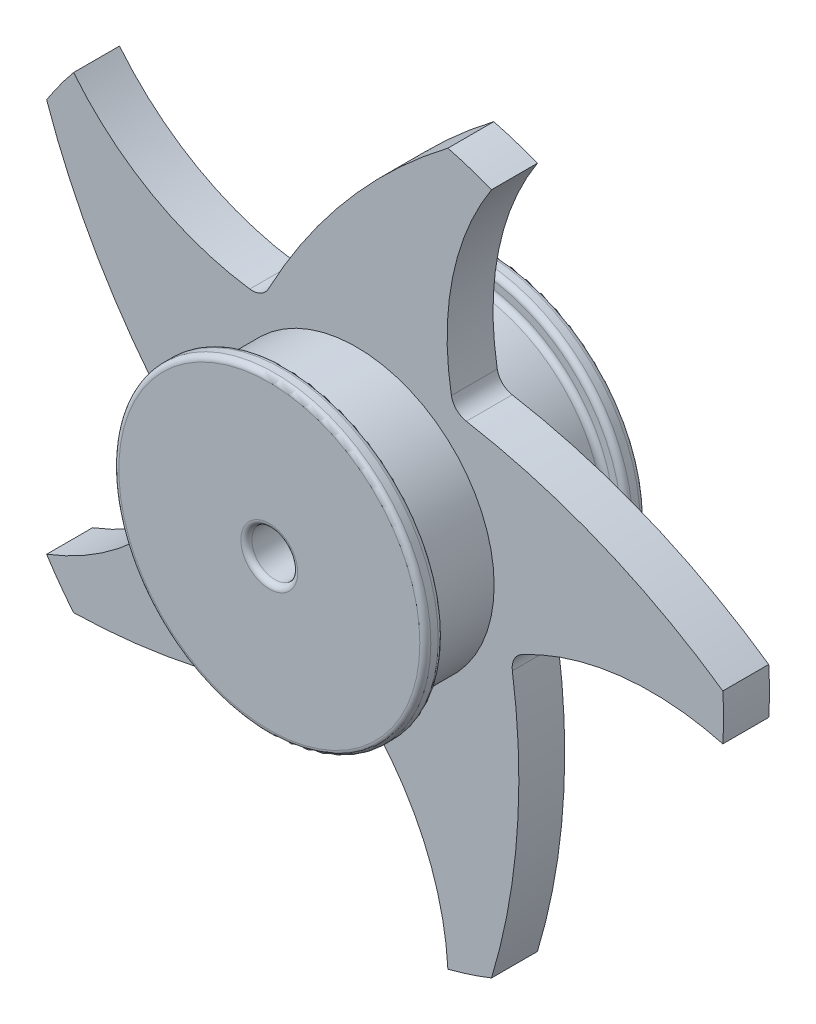
ISO-10303-21;
HEADER;
FILE_DESCRIPTION(('STEP AP214'),'2;1');
FILE_NAME('part.step','',(''),(''),'','','');
FILE_SCHEMA(('AUTOMOTIVE_DESIGN { 1 0 10303 214 1 1 1 1 }'));
ENDSEC;
DATA;
#1=APPLICATION_CONTEXT('core data for automotive mechanical design processes');
#2=APPLICATION_PROTOCOL_DEFINITION('international standard','automotive_design',2000,#1);
#3=PRODUCT_CONTEXT('',#1,'mechanical');
#4=PRODUCT('Part','Part','',(#3));
#5=PRODUCT_RELATED_PRODUCT_CATEGORY('part','',(#4));
#6=PRODUCT_DEFINITION_FORMATION('','',#4);
#7=PRODUCT_DEFINITION_CONTEXT('part definition',#1,'design');
#8=PRODUCT_DEFINITION('design','',#6,#7);
#9=PRODUCT_DEFINITION_SHAPE('','',#8);
#10=(LENGTH_UNIT() NAMED_UNIT(*) SI_UNIT(.MILLI.,.METRE.));
#11=(NAMED_UNIT(*) PLANE_ANGLE_UNIT() SI_UNIT($,.RADIAN.));
#12=(NAMED_UNIT(*) SI_UNIT($,.STERADIAN.) SOLID_ANGLE_UNIT());
#13=UNCERTAINTY_MEASURE_WITH_UNIT(LENGTH_MEASURE(1.E-05),#10,'distance_accuracy_value','');
#14=(GEOMETRIC_REPRESENTATION_CONTEXT(3) GLOBAL_UNCERTAINTY_ASSIGNED_CONTEXT((#13)) GLOBAL_UNIT_ASSIGNED_CONTEXT((#10,
#11,#12)) REPRESENTATION_CONTEXT('',''));
#15=CARTESIAN_POINT('',(0.,0.,0.));
#16=DIRECTION('',(0.,0.,1.));
#17=DIRECTION('',(1.,0.,0.));
#18=AXIS2_PLACEMENT_3D('',#15,#16,#17);
#19=CARTESIAN_POINT('',(0.,0.,60.));
#20=DIRECTION('',(0.,0.,-1.));
#21=DIRECTION('',(-1.,0.,0.));
#22=AXIS2_PLACEMENT_3D('',#19,#20,#21);
#23=CYLINDRICAL_SURFACE('',#22,75.);
#24=CARTESIAN_POINT('',(0.,0.,-47.));
#25=DIRECTION('',(0.,0.,-1.));
#26=DIRECTION('',(-1.,0.,0.));
#27=AXIS2_PLACEMENT_3D('',#24,#25,#26);
#28=CIRCLE('',#27,75.);
#29=CARTESIAN_POINT('',(-75.,0.,-47.));
#30=VERTEX_POINT('',#29);
#31=EDGE_CURVE('E387',#30,#30,#28,.F.);
#32=ORIENTED_EDGE('',*,*,#31,.T.);
#33=EDGE_LOOP('',(#32));
#34=FACE_BOUND('',#33,.T.);
#35=CARTESIAN_POINT('',(0.,0.,-12.5));
#36=DIRECTION('',(0.,0.,-1.));
#37=DIRECTION('',(1.,0.,0.));
#38=AXIS2_PLACEMENT_3D('',#35,#36,#37);
#39=CIRCLE('',#38,75.);
#40=CARTESIAN_POINT('',(75.,0.,-12.5));
#41=VERTEX_POINT('',#40);
#42=EDGE_CURVE('E305',#41,#41,#39,.T.);
#43=ORIENTED_EDGE('',*,*,#42,.T.);
#44=EDGE_LOOP('',(#43));
#45=FACE_BOUND('',#44,.T.);
#46=ADVANCED_FACE('F41',(#34,#45),#23,.T.);
#47=CARTESIAN_POINT('',(160.789981202373,-157.389904202718,12.5));
#48=DIRECTION('',(0.,0.,-1.));
#49=DIRECTION('',(-1.,0.,0.));
#50=AXIS2_PLACEMENT_3D('',#47,#48,#49);
#51=CYLINDRICAL_SURFACE('',#50,150.);
#52=CARTESIAN_POINT('',(160.789981202373,-157.389904202718,12.5));
#53=DIRECTION('',(0.,0.,-1.));
#54=DIRECTION('',(-1.,0.,0.));
#55=AXIS2_PLACEMENT_3D('',#52,#53,#54);
#56=CIRCLE('',#55,150.);
#57=CARTESIAN_POINT('',(90.1061457749531,-25.0879941285639,12.5));
#58=VERTEX_POINT('',#57);
#59=CARTESIAN_POINT('',(199.608992783391,-12.5,12.5));
#60=VERTEX_POINT('',#59);
#61=EDGE_CURVE('E310',#58,#60,#56,.T.);
#62=ORIENTED_EDGE('',*,*,#61,.F.);
#63=DIRECTION('',(0.,0.,-1.));
#64=VECTOR('',#63,1.);
#65=CARTESIAN_POINT('',(90.1061457749531,-25.0879941285639,12.5));
#66=LINE('',#65,#64);
#67=CARTESIAN_POINT('',(90.1061457749531,-25.0879941285639,-12.5));
#68=VERTEX_POINT('',#67);
#69=EDGE_CURVE('E428',#58,#68,#66,.T.);
#70=ORIENTED_EDGE('',*,*,#69,.T.);
#71=CARTESIAN_POINT('',(160.789981202373,-157.389904202718,-12.5));
#72=DIRECTION('',(0.,0.,-1.));
#73=DIRECTION('',(-1.,0.,0.));
#74=AXIS2_PLACEMENT_3D('',#71,#72,#73);
#75=CIRCLE('',#74,150.);
#76=CARTESIAN_POINT('',(199.608992783391,-12.5,-12.5));
#77=VERTEX_POINT('',#76);
#78=EDGE_CURVE('E324',#68,#77,#75,.T.);
#79=ORIENTED_EDGE('',*,*,#78,.T.);
#80=DIRECTION('',(0.,0.,-1.));
#81=VECTOR('',#80,1.);
#82=CARTESIAN_POINT('',(199.608992783391,-12.5,12.5));
#83=LINE('',#82,#81);
#84=EDGE_CURVE('E335',#60,#77,#83,.T.);
#85=ORIENTED_EDGE('',*,*,#84,.F.);
#86=EDGE_LOOP('',(#62,#70,#79,#85));
#87=FACE_BOUND('',#86,.T.);
#88=ADVANCED_FACE('F478',(#87),#51,.F.);
#89=CARTESIAN_POINT('',(0.,-275.,12.5));
#90=DIRECTION('',(0.,0.,-1.));
#91=DIRECTION('',(-1.,0.,0.));
#92=AXIS2_PLACEMENT_3D('',#89,#90,#91);
#93=CYLINDRICAL_SURFACE('',#92,350.);
#94=CARTESIAN_POINT('',(0.,-275.,-12.5));
#95=DIRECTION('',(0.,0.,1.));
#96=DIRECTION('',(-1.,0.,0.));
#97=AXIS2_PLACEMENT_3D('',#94,#95,#96);
#98=CIRCLE('',#97,350.);
#99=CARTESIAN_POINT('',(199.608992783391,12.5,-12.5));
#100=VERTEX_POINT('',#99);
#101=CARTESIAN_POINT('',(59.8393418292631,69.8467096688624,-12.5));
#102=VERTEX_POINT('',#101);
#103=EDGE_CURVE('E311',#100,#102,#98,.T.);
#104=ORIENTED_EDGE('',*,*,#103,.T.);
#105=DIRECTION('',(0.,0.,-1.));
#106=VECTOR('',#105,1.);
#107=CARTESIAN_POINT('',(59.8393418292631,69.8467096688624,12.5));
#108=LINE('',#107,#106);
#109=CARTESIAN_POINT('',(59.8393418292631,69.8467096688624,12.5));
#110=VERTEX_POINT('',#109);
#111=EDGE_CURVE('E63',#102,#110,#108,.F.);
#112=ORIENTED_EDGE('',*,*,#111,.T.);
#113=CARTESIAN_POINT('',(0.,-275.,12.5));
#114=DIRECTION('',(0.,0.,1.));
#115=DIRECTION('',(-1.,0.,0.));
#116=AXIS2_PLACEMENT_3D('',#113,#114,#115);
#117=CIRCLE('',#116,350.);
#118=CARTESIAN_POINT('',(199.608992783391,12.5,12.5));
#119=VERTEX_POINT('',#118);
#120=EDGE_CURVE('E317',#119,#110,#117,.T.);
#121=ORIENTED_EDGE('',*,*,#120,.F.);
#122=DIRECTION('',(0.,0.,-1.));
#123=VECTOR('',#122,1.);
#124=CARTESIAN_POINT('',(199.608992783391,12.5,12.5));
#125=LINE('',#124,#123);
#126=EDGE_CURVE('E320',#119,#100,#125,.T.);
#127=ORIENTED_EDGE('',*,*,#126,.T.);
#128=EDGE_LOOP('',(#104,#112,#121,#127));
#129=FACE_BOUND('',#128,.T.);
#130=ADVANCED_FACE('F554',(#129),#93,.T.);
#131=CARTESIAN_POINT('',(0.,0.,12.5));
#132=DIRECTION('',(0.,0.,-1.));
#133=DIRECTION('',(1.,0.,0.));
#134=AXIS2_PLACEMENT_3D('',#131,#132,#133);
#135=CIRCLE('',#134,75.);
#136=CARTESIAN_POINT('',(75.,0.,12.5));
#137=VERTEX_POINT('',#136);
#138=EDGE_CURVE('E306',#137,#137,#135,.T.);
#139=ORIENTED_EDGE('',*,*,#138,.F.);
#140=EDGE_LOOP('',(#139));
#141=FACE_BOUND('',#140,.T.);
#142=CARTESIAN_POINT('',(0.,0.,47.));
#143=DIRECTION('',(0.,0.,1.));
#144=DIRECTION('',(1.,0.,0.));
#145=AXIS2_PLACEMENT_3D('',#142,#143,#144);
#146=CIRCLE('',#145,75.);
#147=CARTESIAN_POINT('',(75.,0.,47.));
#148=VERTEX_POINT('',#147);
#149=EDGE_CURVE('E367',#148,#148,#146,.F.);
#150=ORIENTED_EDGE('',*,*,#149,.T.);
#151=EDGE_LOOP('',(#150));
#152=FACE_BOUND('',#151,.T.);
#153=ADVANCED_FACE('F550',(#141,#152),#23,.T.);
#154=CARTESIAN_POINT('',(0.,0.,60.));
#155=DIRECTION('',(0.,0.,1.));
#156=DIRECTION('',(1.,0.,0.));
#157=AXIS2_PLACEMENT_3D('',#154,#155,#156);
#158=PLANE('',#157);
#159=CARTESIAN_POINT('',(0.,0.,60.));
#160=DIRECTION('',(0.,0.,1.));
#161=DIRECTION('',(1.,0.,0.));
#162=AXIS2_PLACEMENT_3D('',#159,#160,#161);
#163=CIRCLE('',#162,15.5);
#164=CARTESIAN_POINT('',(15.5,0.,60.));
#165=VERTEX_POINT('',#164);
#166=EDGE_CURVE('E355',#165,#165,#163,.F.);
#167=ORIENTED_EDGE('',*,*,#166,.T.);
#168=EDGE_LOOP('',(#167));
#169=FACE_BOUND('',#168,.T.);
#170=CARTESIAN_POINT('',(0.,0.,60.));
#171=DIRECTION('',(0.,0.,1.));
#172=DIRECTION('',(1.,0.,0.));
#173=AXIS2_PLACEMENT_3D('',#170,#171,#172);
#174=CIRCLE('',#173,82.);
#175=CARTESIAN_POINT('',(82.,0.,60.));
#176=VERTEX_POINT('',#175);
#177=EDGE_CURVE('E351',#176,#176,#174,.T.);
#178=ORIENTED_EDGE('',*,*,#177,.T.);
#179=EDGE_LOOP('',(#178));
#180=FACE_BOUND('',#179,.T.);
#181=ADVANCED_FACE('F560',(#169,#180),#158,.T.);
#182=CARTESIAN_POINT('',(0.,0.,-60.));
#183=DIRECTION('',(0.,0.,1.));
#184=DIRECTION('',(1.,0.,0.));
#185=AXIS2_PLACEMENT_3D('',#182,#183,#184);
#186=PLANE('',#185);
#187=CARTESIAN_POINT('',(0.,0.,-60.));
#188=DIRECTION('',(0.,0.,1.));
#189=DIRECTION('',(1.,0.,0.));
#190=AXIS2_PLACEMENT_3D('',#187,#188,#189);
#191=CIRCLE('',#190,82.);
#192=CARTESIAN_POINT('',(82.,0.,-60.));
#193=VERTEX_POINT('',#192);
#194=EDGE_CURVE('E399',#193,#193,#191,.F.);
#195=ORIENTED_EDGE('',*,*,#194,.T.);
#196=EDGE_LOOP('',(#195));
#197=FACE_BOUND('',#196,.T.);
#198=CARTESIAN_POINT('',(0.,0.,-60.));
#199=DIRECTION('',(0.,0.,1.));
#200=DIRECTION('',(1.,0.,0.));
#201=AXIS2_PLACEMENT_3D('',#198,#199,#200);
#202=CIRCLE('',#201,15.5);
#203=CARTESIAN_POINT('',(15.5,0.,-60.));
#204=VERTEX_POINT('',#203);
#205=EDGE_CURVE('E339',#204,#204,#202,.T.);
#206=ORIENTED_EDGE('',*,*,#205,.T.);
#207=EDGE_LOOP('',(#206));
#208=FACE_BOUND('',#207,.T.);
#209=ADVANCED_FACE('F566',(#197,#208),#186,.F.);
#210=CARTESIAN_POINT('',(0.,0.,60.));
#211=DIRECTION('',(0.,0.,-1.));
#212=DIRECTION('',(-1.,0.,0.));
#213=AXIS2_PLACEMENT_3D('',#210,#211,#212);
#214=CYLINDRICAL_SURFACE('',#213,12.5);
#215=CARTESIAN_POINT('',(0.,0.,-57.));
#216=DIRECTION('',(0.,0.,1.));
#217=DIRECTION('',(1.,0.,0.));
#218=AXIS2_PLACEMENT_3D('',#215,#216,#217);
#219=CIRCLE('',#218,12.5);
#220=CARTESIAN_POINT('',(12.5,0.,-57.));
#221=VERTEX_POINT('',#220);
#222=EDGE_CURVE('E347',#221,#221,#219,.F.);
#223=ORIENTED_EDGE('',*,*,#222,.T.);
#224=EDGE_LOOP('',(#223));
#225=FACE_BOUND('',#224,.T.);
#226=CARTESIAN_POINT('',(0.,0.,57.));
#227=DIRECTION('',(0.,0.,1.));
#228=DIRECTION('',(1.,0.,0.));
#229=AXIS2_PLACEMENT_3D('',#226,#227,#228);
#230=CIRCLE('',#229,12.5);
#231=CARTESIAN_POINT('',(12.5,0.,57.));
#232=VERTEX_POINT('',#231);
#233=EDGE_CURVE('E343',#232,#232,#230,.T.);
#234=ORIENTED_EDGE('',*,*,#233,.T.);
#235=EDGE_LOOP('',(#234));
#236=FACE_BOUND('',#235,.T.);
#237=ADVANCED_FACE('F598',(#225,#236),#214,.F.);
#238=CARTESIAN_POINT('',(0.,0.,50.));
#239=DIRECTION('',(0.,0.,1.));
#240=DIRECTION('',(1.,0.,0.));
#241=AXIS2_PLACEMENT_3D('',#238,#239,#240);
#242=CYLINDRICAL_SURFACE('',#241,85.);
#243=CARTESIAN_POINT('',(0.,0.,53.));
#244=DIRECTION('',(0.,0.,1.));
#245=DIRECTION('',(1.,0.,0.));
#246=AXIS2_PLACEMENT_3D('',#243,#244,#245);
#247=CIRCLE('',#246,85.);
#248=CARTESIAN_POINT('',(85.,0.,53.));
#249=VERTEX_POINT('',#248);
#250=EDGE_CURVE('E375',#249,#249,#247,.T.);
#251=ORIENTED_EDGE('',*,*,#250,.T.);
#252=EDGE_LOOP('',(#251));
#253=FACE_BOUND('',#252,.T.);
#254=CARTESIAN_POINT('',(0.,0.,57.));
#255=DIRECTION('',(0.,0.,1.));
#256=DIRECTION('',(1.,0.,0.));
#257=AXIS2_PLACEMENT_3D('',#254,#255,#256);
#258=CIRCLE('',#257,85.);
#259=CARTESIAN_POINT('',(85.,0.,57.));
#260=VERTEX_POINT('',#259);
#261=EDGE_CURVE('E371',#260,#260,#258,.F.);
#262=ORIENTED_EDGE('',*,*,#261,.T.);
#263=EDGE_LOOP('',(#262));
#264=FACE_BOUND('',#263,.T.);
#265=ADVANCED_FACE('F586',(#253,#264),#242,.T.);
#266=CARTESIAN_POINT('',(0.,0.,50.));
#267=DIRECTION('',(0.,0.,1.));
#268=DIRECTION('',(1.,0.,0.));
#269=AXIS2_PLACEMENT_3D('',#266,#267,#268);
#270=PLANE('',#269);
#271=CARTESIAN_POINT('',(0.,0.,50.));
#272=DIRECTION('',(0.,0.,1.));
#273=DIRECTION('',(1.,0.,0.));
#274=AXIS2_PLACEMENT_3D('',#271,#272,#273);
#275=CIRCLE('',#274,78.);
#276=CARTESIAN_POINT('',(78.,0.,50.));
#277=VERTEX_POINT('',#276);
#278=EDGE_CURVE('E363',#277,#277,#275,.T.);
#279=ORIENTED_EDGE('',*,*,#278,.T.);
#280=EDGE_LOOP('',(#279));
#281=FACE_BOUND('',#280,.T.);
#282=CARTESIAN_POINT('',(0.,0.,50.));
#283=DIRECTION('',(0.,0.,1.));
#284=DIRECTION('',(1.,0.,0.));
#285=AXIS2_PLACEMENT_3D('',#282,#283,#284);
#286=CIRCLE('',#285,82.);
#287=CARTESIAN_POINT('',(82.,0.,50.));
#288=VERTEX_POINT('',#287);
#289=EDGE_CURVE('E359',#288,#288,#286,.F.);
#290=ORIENTED_EDGE('',*,*,#289,.T.);
#291=EDGE_LOOP('',(#290));
#292=FACE_BOUND('',#291,.T.);
#293=ADVANCED_FACE('F582',(#281,#292),#270,.F.);
#294=CARTESIAN_POINT('',(0.,0.,-57.));
#295=DIRECTION('',(0.,0.,1.));
#296=DIRECTION('',(1.,0.,0.));
#297=AXIS2_PLACEMENT_3D('',#294,#295,#296);
#298=TOROIDAL_SURFACE('',#297,15.5,3.);
#299=ORIENTED_EDGE('',*,*,#222,.F.);
#300=EDGE_LOOP('',(#299));
#301=FACE_BOUND('',#300,.T.);
#302=ORIENTED_EDGE('',*,*,#205,.F.);
#303=EDGE_LOOP('',(#302));
#304=FACE_BOUND('',#303,.T.);
#305=ADVANCED_FACE('F585',(#301,#304),#298,.T.);
#306=CARTESIAN_POINT('',(0.,0.,57.));
#307=DIRECTION('',(0.,0.,1.));
#308=DIRECTION('',(1.,0.,0.));
#309=AXIS2_PLACEMENT_3D('',#306,#307,#308);
#310=TOROIDAL_SURFACE('',#309,15.5,3.);
#311=ORIENTED_EDGE('',*,*,#166,.F.);
#312=EDGE_LOOP('',(#311));
#313=FACE_BOUND('',#312,.T.);
#314=ORIENTED_EDGE('',*,*,#233,.F.);
#315=EDGE_LOOP('',(#314));
#316=FACE_BOUND('',#315,.T.);
#317=ADVANCED_FACE('F578',(#313,#316),#310,.T.);
#318=CARTESIAN_POINT('',(0.,0.,47.));
#319=DIRECTION('',(0.,0.,1.));
#320=DIRECTION('',(1.,0.,0.));
#321=AXIS2_PLACEMENT_3D('',#318,#319,#320);
#322=TOROIDAL_SURFACE('',#321,78.,3.);
#323=ORIENTED_EDGE('',*,*,#149,.F.);
#324=EDGE_LOOP('',(#323));
#325=FACE_BOUND('',#324,.T.);
#326=ORIENTED_EDGE('',*,*,#278,.F.);
#327=EDGE_LOOP('',(#326));
#328=FACE_BOUND('',#327,.T.);
#329=ADVANCED_FACE('F574',(#325,#328),#322,.F.);
#330=CARTESIAN_POINT('',(0.,0.,53.));
#331=DIRECTION('',(0.,0.,1.));
#332=DIRECTION('',(1.,0.,0.));
#333=AXIS2_PLACEMENT_3D('',#330,#331,#332);
#334=TOROIDAL_SURFACE('',#333,82.,3.);
#335=ORIENTED_EDGE('',*,*,#289,.F.);
#336=EDGE_LOOP('',(#335));
#337=FACE_BOUND('',#336,.T.);
#338=ORIENTED_EDGE('',*,*,#250,.F.);
#339=EDGE_LOOP('',(#338));
#340=FACE_BOUND('',#339,.T.);
#341=ADVANCED_FACE('F577',(#337,#340),#334,.T.);
#342=CARTESIAN_POINT('',(0.,0.,57.));
#343=DIRECTION('',(0.,0.,1.));
#344=DIRECTION('',(1.,0.,0.));
#345=AXIS2_PLACEMENT_3D('',#342,#343,#344);
#346=TOROIDAL_SURFACE('',#345,82.,3.);
#347=ORIENTED_EDGE('',*,*,#261,.F.);
#348=EDGE_LOOP('',(#347));
#349=FACE_BOUND('',#348,.T.);
#350=ORIENTED_EDGE('',*,*,#177,.F.);
#351=EDGE_LOOP('',(#350));
#352=FACE_BOUND('',#351,.T.);
#353=ADVANCED_FACE('F592',(#349,#352),#346,.T.);
#354=CARTESIAN_POINT('',(0.,0.,-50.));
#355=DIRECTION('',(0.,0.,-1.));
#356=DIRECTION('',(1.,0.,0.));
#357=AXIS2_PLACEMENT_3D('',#354,#355,#356);
#358=PLANE('',#357);
#359=CARTESIAN_POINT('',(0.,0.,-50.));
#360=DIRECTION('',(0.,0.,-1.));
#361=DIRECTION('',(-1.,0.,0.));
#362=AXIS2_PLACEMENT_3D('',#359,#360,#361);
#363=CIRCLE('',#362,78.);
#364=CARTESIAN_POINT('',(-78.,0.,-50.));
#365=VERTEX_POINT('',#364);
#366=EDGE_CURVE('E383',#365,#365,#363,.T.);
#367=ORIENTED_EDGE('',*,*,#366,.T.);
#368=EDGE_LOOP('',(#367));
#369=FACE_BOUND('',#368,.T.);
#370=CARTESIAN_POINT('',(0.,0.,-50.));
#371=DIRECTION('',(0.,0.,-1.));
#372=DIRECTION('',(-1.,0.,0.));
#373=AXIS2_PLACEMENT_3D('',#370,#371,#372);
#374=CIRCLE('',#373,82.);
#375=CARTESIAN_POINT('',(-82.,0.,-50.));
#376=VERTEX_POINT('',#375);
#377=EDGE_CURVE('E379',#376,#376,#374,.F.);
#378=ORIENTED_EDGE('',*,*,#377,.T.);
#379=EDGE_LOOP('',(#378));
#380=FACE_BOUND('',#379,.T.);
#381=ADVANCED_FACE('F604',(#369,#380),#358,.F.);
#382=CARTESIAN_POINT('',(0.,0.,-50.));
#383=DIRECTION('',(0.,0.,-1.));
#384=DIRECTION('',(-1.,0.,0.));
#385=AXIS2_PLACEMENT_3D('',#382,#383,#384);
#386=CYLINDRICAL_SURFACE('',#385,85.);
#387=CARTESIAN_POINT('',(0.,0.,-53.));
#388=DIRECTION('',(0.,0.,-1.));
#389=DIRECTION('',(-1.,0.,0.));
#390=AXIS2_PLACEMENT_3D('',#387,#388,#389);
#391=CIRCLE('',#390,85.);
#392=CARTESIAN_POINT('',(-85.,0.,-53.));
#393=VERTEX_POINT('',#392);
#394=EDGE_CURVE('E395',#393,#393,#391,.T.);
#395=ORIENTED_EDGE('',*,*,#394,.T.);
#396=EDGE_LOOP('',(#395));
#397=FACE_BOUND('',#396,.T.);
#398=CARTESIAN_POINT('',(0.,0.,-57.));
#399=DIRECTION('',(0.,0.,1.));
#400=DIRECTION('',(1.,0.,0.));
#401=AXIS2_PLACEMENT_3D('',#398,#399,#400);
#402=CIRCLE('',#401,85.);
#403=CARTESIAN_POINT('',(85.,0.,-57.));
#404=VERTEX_POINT('',#403);
#405=EDGE_CURVE('E391',#404,#404,#402,.T.);
#406=ORIENTED_EDGE('',*,*,#405,.T.);
#407=EDGE_LOOP('',(#406));
#408=FACE_BOUND('',#407,.T.);
#409=ADVANCED_FACE('F611',(#397,#408),#386,.T.);
#410=CARTESIAN_POINT('',(0.,0.,-47.));
#411=DIRECTION('',(0.,0.,-1.));
#412=DIRECTION('',(-1.,0.,0.));
#413=AXIS2_PLACEMENT_3D('',#410,#411,#412);
#414=TOROIDAL_SURFACE('',#413,78.,3.);
#415=ORIENTED_EDGE('',*,*,#31,.F.);
#416=EDGE_LOOP('',(#415));
#417=FACE_BOUND('',#416,.T.);
#418=ORIENTED_EDGE('',*,*,#366,.F.);
#419=EDGE_LOOP('',(#418));
#420=FACE_BOUND('',#419,.T.);
#421=ADVANCED_FACE('F615',(#417,#420),#414,.F.);
#422=CARTESIAN_POINT('',(0.,0.,-53.));
#423=DIRECTION('',(0.,0.,-1.));
#424=DIRECTION('',(-1.,0.,0.));
#425=AXIS2_PLACEMENT_3D('',#422,#423,#424);
#426=TOROIDAL_SURFACE('',#425,82.,3.);
#427=ORIENTED_EDGE('',*,*,#394,.F.);
#428=EDGE_LOOP('',(#427));
#429=FACE_BOUND('',#428,.T.);
#430=ORIENTED_EDGE('',*,*,#377,.F.);
#431=EDGE_LOOP('',(#430));
#432=FACE_BOUND('',#431,.T.);
#433=ADVANCED_FACE('F618',(#429,#432),#426,.T.);
#434=CARTESIAN_POINT('',(0.,0.,-57.));
#435=DIRECTION('',(0.,0.,1.));
#436=DIRECTION('',(1.,0.,0.));
#437=AXIS2_PLACEMENT_3D('',#434,#435,#436);
#438=TOROIDAL_SURFACE('',#437,82.,3.);
#439=ORIENTED_EDGE('',*,*,#194,.F.);
#440=EDGE_LOOP('',(#439));
#441=FACE_BOUND('',#440,.T.);
#442=ORIENTED_EDGE('',*,*,#405,.F.);
#443=EDGE_LOOP('',(#442));
#444=FACE_BOUND('',#443,.T.);
#445=ADVANCED_FACE('F622',(#441,#444),#438,.T.);
#446=CARTESIAN_POINT('',(0.,0.,12.5));
#447=DIRECTION('',(0.,0.,-1.));
#448=DIRECTION('',(-1.,0.,0.));
#449=AXIS2_PLACEMENT_3D('',#446,#447,#448);
#450=CYLINDRICAL_SURFACE('',#449,200.);
#451=CARTESIAN_POINT('',(0.,0.,-12.5));
#452=DIRECTION('',(0.,0.,1.));
#453=DIRECTION('',(1.,0.,0.));
#454=AXIS2_PLACEMENT_3D('',#451,#452,#453);
#455=CIRCLE('',#454,200.);
#456=EDGE_CURVE('E327',#77,#100,#455,.T.);
#457=ORIENTED_EDGE('',*,*,#456,.T.);
#458=ORIENTED_EDGE('',*,*,#126,.F.);
#459=CARTESIAN_POINT('',(0.,0.,12.5));
#460=DIRECTION('',(0.,0.,1.));
#461=DIRECTION('',(1.,0.,0.));
#462=AXIS2_PLACEMENT_3D('',#459,#460,#461);
#463=CIRCLE('',#462,200.);
#464=EDGE_CURVE('E314',#60,#119,#463,.T.);
#465=ORIENTED_EDGE('',*,*,#464,.F.);
#466=ORIENTED_EDGE('',*,*,#84,.T.);
#467=EDGE_LOOP('',(#457,#458,#465,#466));
#468=FACE_BOUND('',#467,.T.);
#469=ADVANCED_FACE('F482',(#468),#450,.T.);
#470=CARTESIAN_POINT('',(0.,-137.5,12.5));
#471=DIRECTION('',(0.,0.,1.));
#472=DIRECTION('',(1.,0.,0.));
#473=AXIS2_PLACEMENT_3D('',#470,#471,#472);
#474=PLANE('',#473);
#475=CARTESIAN_POINT('',(-261.540541981167,-84.9796734531098,12.5));
#476=DIRECTION('',(0.,0.,1.));
#477=DIRECTION('',(-0.309016994374945,0.951056516295155,0.));
#478=AXIS2_PLACEMENT_3D('',#475,#476,#477);
#479=CIRCLE('',#478,350.);
#480=CARTESIAN_POINT('',(73.5707774538231,-185.97672086807,12.5));
#481=VERTEX_POINT('',#480);
#482=CARTESIAN_POINT('',(84.919541929801,-35.3267756886817,12.5));
#483=VERTEX_POINT('',#482);
#484=EDGE_CURVE('E286',#481,#483,#479,.T.);
#485=ORIENTED_EDGE('',*,*,#484,.T.);
#486=CARTESIAN_POINT('',(94.8184014701144,-33.9081214668409,12.5));
#487=DIRECTION('',(0.,0.,1.));
#488=DIRECTION('',(1.,0.,0.));
#489=AXIS2_PLACEMENT_3D('',#486,#487,#488);
#490=CIRCLE('',#489,10.);
#491=EDGE_CURVE('E454',#483,#58,#490,.F.);
#492=ORIENTED_EDGE('',*,*,#491,.T.);
#493=ORIENTED_EDGE('',*,*,#61,.T.);
#494=ORIENTED_EDGE('',*,*,#464,.T.);
#495=ORIENTED_EDGE('',*,*,#120,.T.);
#496=CARTESIAN_POINT('',(61.5490373100992,79.6994728022585,12.5));
#497=DIRECTION('',(0.,0.,1.));
#498=DIRECTION('',(1.,0.,0.));
#499=AXIS2_PLACEMENT_3D('',#496,#497,#498);
#500=CIRCLE('',#499,10.);
#501=CARTESIAN_POINT('',(51.7044306388329,77.9434205570052,12.5));
#502=VERTEX_POINT('',#501);
#503=EDGE_CURVE('E11',#110,#502,#500,.F.);
#504=ORIENTED_EDGE('',*,*,#503,.T.);
#505=CARTESIAN_POINT('',(199.373530707827,104.284204235805,12.5));
#506=DIRECTION('',(0.,0.,-1.));
#507=DIRECTION('',(-0.309016994374958,-0.95105651629515,0.));
#508=AXIS2_PLACEMENT_3D('',#505,#506,#507);
#509=CIRCLE('',#508,150.);
#510=CARTESIAN_POINT('',(73.5707774538257,185.976720868069,12.5));
#511=VERTEX_POINT('',#510);
#512=EDGE_CURVE('E178',#502,#511,#509,.T.);
#513=ORIENTED_EDGE('',*,*,#512,.T.);
#514=CARTESIAN_POINT('',(0.,0.,12.5));
#515=DIRECTION('',(0.,0.,1.));
#516=DIRECTION('',(0.309016994374958,0.95105651629515,0.));
#517=AXIS2_PLACEMENT_3D('',#514,#515,#516);
#518=CIRCLE('',#517,200.);
#519=CARTESIAN_POINT('',(49.794364546447,193.702145727443,12.5));
#520=VERTEX_POINT('',#519);
#521=EDGE_CURVE('E185',#511,#520,#518,.T.);
#522=ORIENTED_EDGE('',*,*,#521,.T.);
#523=CARTESIAN_POINT('',(261.540541981166,-84.9796734531135,12.5));
#524=DIRECTION('',(0.,0.,1.));
#525=DIRECTION('',(-0.309016994374958,-0.95105651629515,0.));
#526=AXIS2_PLACEMENT_3D('',#523,#524,#525);
#527=CIRCLE('',#526,350.);
#528=CARTESIAN_POINT('',(-47.9367948148929,78.494416266385,12.5));
#529=VERTEX_POINT('',#528);
#530=EDGE_CURVE('E208',#520,#529,#527,.T.);
#531=ORIENTED_EDGE('',*,*,#530,.T.);
#532=CARTESIAN_POINT('',(-56.7790044376374,83.165104544085,12.5));
#533=DIRECTION('',(0.,0.,1.));
#534=DIRECTION('',(1.,0.,0.));
#535=AXIS2_PLACEMENT_3D('',#532,#533,#534);
#536=CIRCLE('',#535,10.);
#537=CARTESIAN_POINT('',(-58.1510502711927,73.2596772322208,12.5));
#538=VERTEX_POINT('',#537);
#539=EDGE_CURVE('E442',#529,#538,#536,.F.);
#540=ORIENTED_EDGE('',*,*,#539,.T.);
#541=CARTESIAN_POINT('',(-37.5703627678633,221.841086910182,12.5));
#542=DIRECTION('',(0.,0.,-1.));
#543=DIRECTION('',(0.809016994374942,-0.58778525229248,0.));
#544=AXIS2_PLACEMENT_3D('',#541,#542,#543);
#545=CIRCLE('',#544,150.);
#546=CARTESIAN_POINT('',(-154.139751738173,127.43993461272,12.5));
#547=VERTEX_POINT('',#546);
#548=EDGE_CURVE('E223',#538,#547,#545,.T.);
#549=ORIENTED_EDGE('',*,*,#548,.T.);
#550=CARTESIAN_POINT('',(0.,0.,12.5));
#551=DIRECTION('',(0.,0.,1.));
#552=DIRECTION('',(-0.809016994374942,0.58778525229248,0.));
#553=AXIS2_PLACEMENT_3D('',#550,#551,#552);
#554=CIRCLE('',#553,200.);
#555=CARTESIAN_POINT('',(-168.834383045485,107.214509753347,12.5));
#556=VERTEX_POINT('',#555);
#557=EDGE_CURVE('E226',#547,#556,#554,.T.);
#558=ORIENTED_EDGE('',*,*,#557,.T.);
#559=CARTESIAN_POINT('',(161.640944380432,222.479673453109,12.5));
#560=DIRECTION('',(0.,0.,1.));
#561=DIRECTION('',(0.809016994374942,-0.58778525229248,0.));
#562=AXIS2_PLACEMENT_3D('',#559,#560,#561);
#563=CIRCLE('',#562,350.);
#564=CARTESIAN_POINT('',(-89.4659103365965,-21.3344924891536,12.5));
#565=VERTEX_POINT('',#564);
#566=EDGE_CURVE('E230',#556,#565,#563,.T.);
#567=ORIENTED_EDGE('',*,*,#566,.T.);
#568=CARTESIAN_POINT('',(-96.6403918999401,-28.3006115160754,12.5));
#569=DIRECTION('',(0.,0.,1.));
#570=DIRECTION('',(1.,0.,0.));
#571=AXIS2_PLACEMENT_3D('',#568,#569,#570);
#572=CIRCLE('',#571,10.);
#573=CARTESIAN_POINT('',(-87.6437561879337,-32.6664500226455,12.5));
#574=VERTEX_POINT('',#573);
#575=EDGE_CURVE('E436',#565,#574,#572,.F.);
#576=ORIENTED_EDGE('',*,*,#575,.T.);
#577=CARTESIAN_POINT('',(-222.59329186803,32.8211275759061,12.5));
#578=DIRECTION('',(0.,0.,-1.));
#579=DIRECTION('',(0.809016994374951,0.587785252292469,0.));
#580=AXIS2_PLACEMENT_3D('',#577,#578,#579);
#581=CIRCLE('',#580,150.);
#582=CARTESIAN_POINT('',(-168.834383045486,-107.214509753344,12.5));
#583=VERTEX_POINT('',#582);
#584=EDGE_CURVE('E251',#574,#583,#581,.T.);
#585=ORIENTED_EDGE('',*,*,#584,.T.);
#586=CARTESIAN_POINT('',(0.,0.,12.5));
#587=DIRECTION('',(0.,0.,1.));
#588=DIRECTION('',(-0.809016994374951,-0.587785252292469,0.));
#589=AXIS2_PLACEMENT_3D('',#586,#587,#588);
#590=CIRCLE('',#589,200.);
#591=CARTESIAN_POINT('',(-154.139751738175,-127.439934612718,12.5));
#592=VERTEX_POINT('',#591);
#593=EDGE_CURVE('E254',#583,#592,#590,.T.);
#594=ORIENTED_EDGE('',*,*,#593,.T.);
#595=CARTESIAN_POINT('',(-161.640944380429,222.479673453111,12.5));
#596=DIRECTION('',(0.,0.,1.));
#597=DIRECTION('',(0.809016994374951,0.587785252292469,0.));
#598=AXIS2_PLACEMENT_3D('',#595,#596,#597);
#599=CIRCLE('',#598,350.);
#600=CARTESIAN_POINT('',(-7.35617860757382,-91.6798577574111,12.5));
#601=VERTEX_POINT('',#600);
#602=EDGE_CURVE('E258',#592,#601,#599,.T.);
#603=ORIENTED_EDGE('',*,*,#602,.T.);
#604=CARTESIAN_POINT('',(-2.94804244263505,-100.655844363426,12.5));
#605=DIRECTION('',(0.,0.,1.));
#606=DIRECTION('',(1.,0.,0.));
#607=AXIS2_PLACEMENT_3D('',#604,#605,#606);
#608=CIRCLE('',#607,10.);
#609=CARTESIAN_POINT('',(3.98423004534129,-93.4486536380154,12.5));
#610=VERTEX_POINT('',#609);
#611=EDGE_CURVE('E448',#601,#610,#608,.F.);
#612=ORIENTED_EDGE('',*,*,#611,.T.);
#613=CARTESIAN_POINT('',(-99.9998572743037,-201.556514519176,12.5));
#614=DIRECTION('',(0.,0.,-1.));
#615=DIRECTION('',(-0.309016994374945,0.951056516295155,0.));
#616=AXIS2_PLACEMENT_3D('',#613,#614,#615);
#617=CIRCLE('',#616,150.);
#618=CARTESIAN_POINT('',(49.7943645464442,-193.702145727444,12.5));
#619=VERTEX_POINT('',#618);
#620=EDGE_CURVE('E279',#610,#619,#617,.T.);
#621=ORIENTED_EDGE('',*,*,#620,.T.);
#622=CARTESIAN_POINT('',(0.,0.,12.5));
#623=DIRECTION('',(0.,0.,1.));
#624=DIRECTION('',(0.309016994374945,-0.951056516295155,0.));
#625=AXIS2_PLACEMENT_3D('',#622,#623,#624);
#626=CIRCLE('',#625,200.);
#627=EDGE_CURVE('E282',#619,#481,#626,.T.);
#628=ORIENTED_EDGE('',*,*,#627,.T.);
#629=EDGE_LOOP('',(#485,#492,#493,#494,#495,#504,#513,#522,#531,#540,#549,#558,#567,#576,#585,
#594,#603,#612,#621,#628));
#630=FACE_BOUND('',#629,.T.);
#631=ORIENTED_EDGE('',*,*,#138,.T.);
#632=EDGE_LOOP('',(#631));
#633=FACE_BOUND('',#632,.T.);
#634=ADVANCED_FACE('F181',(#630,#633),#474,.T.);
#635=CARTESIAN_POINT('',(0.,-137.5,-12.5));
#636=DIRECTION('',(0.,0.,1.));
#637=DIRECTION('',(1.,0.,0.));
#638=AXIS2_PLACEMENT_3D('',#635,#636,#637);
#639=PLANE('',#638);
#640=ORIENTED_EDGE('',*,*,#78,.F.);
#641=CARTESIAN_POINT('',(94.8184014701144,-33.9081214668409,-12.5));
#642=DIRECTION('',(0.,0.,1.));
#643=DIRECTION('',(1.,0.,0.));
#644=AXIS2_PLACEMENT_3D('',#641,#642,#643);
#645=CIRCLE('',#644,10.);
#646=CARTESIAN_POINT('',(84.919541929801,-35.3267756886817,-12.5));
#647=VERTEX_POINT('',#646);
#648=EDGE_CURVE('E457',#68,#647,#645,.T.);
#649=ORIENTED_EDGE('',*,*,#648,.T.);
#650=CARTESIAN_POINT('',(-261.540541981167,-84.9796734531098,-12.5));
#651=DIRECTION('',(0.,0.,1.));
#652=DIRECTION('',(-0.309016994374945,0.951056516295155,0.));
#653=AXIS2_PLACEMENT_3D('',#650,#651,#652);
#654=CIRCLE('',#653,350.);
#655=CARTESIAN_POINT('',(73.5707774538231,-185.97672086807,-12.5));
#656=VERTEX_POINT('',#655);
#657=EDGE_CURVE('E283',#656,#647,#654,.T.);
#658=ORIENTED_EDGE('',*,*,#657,.F.);
#659=CARTESIAN_POINT('',(0.,0.,-12.5));
#660=DIRECTION('',(0.,0.,1.));
#661=DIRECTION('',(0.309016994374945,-0.951056516295155,0.));
#662=AXIS2_PLACEMENT_3D('',#659,#660,#661);
#663=CIRCLE('',#662,200.);
#664=CARTESIAN_POINT('',(49.7943645464442,-193.702145727444,-12.5));
#665=VERTEX_POINT('',#664);
#666=EDGE_CURVE('E292',#665,#656,#663,.T.);
#667=ORIENTED_EDGE('',*,*,#666,.F.);
#668=CARTESIAN_POINT('',(-99.9998572743037,-201.556514519176,-12.5));
#669=DIRECTION('',(0.,0.,-1.));
#670=DIRECTION('',(-0.309016994374945,0.951056516295155,0.));
#671=AXIS2_PLACEMENT_3D('',#668,#669,#670);
#672=CIRCLE('',#671,150.);
#673=CARTESIAN_POINT('',(3.98423004534129,-93.4486536380154,-12.5));
#674=VERTEX_POINT('',#673);
#675=EDGE_CURVE('E278',#674,#665,#672,.T.);
#676=ORIENTED_EDGE('',*,*,#675,.F.);
#677=CARTESIAN_POINT('',(-2.94804244263505,-100.655844363426,-12.5));
#678=DIRECTION('',(0.,0.,1.));
#679=DIRECTION('',(1.,0.,0.));
#680=AXIS2_PLACEMENT_3D('',#677,#678,#679);
#681=CIRCLE('',#680,10.);
#682=CARTESIAN_POINT('',(-7.35617860757382,-91.6798577574111,-12.5));
#683=VERTEX_POINT('',#682);
#684=EDGE_CURVE('E451',#674,#683,#681,.T.);
#685=ORIENTED_EDGE('',*,*,#684,.T.);
#686=CARTESIAN_POINT('',(-161.640944380429,222.479673453111,-12.5));
#687=DIRECTION('',(0.,0.,1.));
#688=DIRECTION('',(0.809016994374951,0.587785252292469,0.));
#689=AXIS2_PLACEMENT_3D('',#686,#687,#688);
#690=CIRCLE('',#689,350.);
#691=CARTESIAN_POINT('',(-154.139751738175,-127.439934612718,-12.5));
#692=VERTEX_POINT('',#691);
#693=EDGE_CURVE('E255',#692,#683,#690,.T.);
#694=ORIENTED_EDGE('',*,*,#693,.F.);
#695=CARTESIAN_POINT('',(0.,0.,-12.5));
#696=DIRECTION('',(0.,0.,1.));
#697=DIRECTION('',(-0.809016994374951,-0.587785252292469,0.));
#698=AXIS2_PLACEMENT_3D('',#695,#696,#697);
#699=CIRCLE('',#698,200.);
#700=CARTESIAN_POINT('',(-168.834383045486,-107.214509753344,-12.5));
#701=VERTEX_POINT('',#700);
#702=EDGE_CURVE('E265',#701,#692,#699,.T.);
#703=ORIENTED_EDGE('',*,*,#702,.F.);
#704=CARTESIAN_POINT('',(-222.59329186803,32.8211275759061,-12.5));
#705=DIRECTION('',(0.,0.,-1.));
#706=DIRECTION('',(0.809016994374951,0.587785252292469,0.));
#707=AXIS2_PLACEMENT_3D('',#704,#705,#706);
#708=CIRCLE('',#707,150.);
#709=CARTESIAN_POINT('',(-87.6437561879337,-32.6664500226455,-12.5));
#710=VERTEX_POINT('',#709);
#711=EDGE_CURVE('E250',#710,#701,#708,.T.);
#712=ORIENTED_EDGE('',*,*,#711,.F.);
#713=CARTESIAN_POINT('',(-96.6403918999401,-28.3006115160754,-12.5));
#714=DIRECTION('',(0.,0.,1.));
#715=DIRECTION('',(1.,0.,0.));
#716=AXIS2_PLACEMENT_3D('',#713,#714,#715);
#717=CIRCLE('',#716,10.);
#718=CARTESIAN_POINT('',(-89.4659103365965,-21.3344924891536,-12.5));
#719=VERTEX_POINT('',#718);
#720=EDGE_CURVE('E439',#710,#719,#717,.T.);
#721=ORIENTED_EDGE('',*,*,#720,.T.);
#722=CARTESIAN_POINT('',(161.640944380432,222.479673453109,-12.5));
#723=DIRECTION('',(0.,0.,1.));
#724=DIRECTION('',(0.809016994374942,-0.58778525229248,0.));
#725=AXIS2_PLACEMENT_3D('',#722,#723,#724);
#726=CIRCLE('',#725,350.);
#727=CARTESIAN_POINT('',(-168.834383045485,107.214509753347,-12.5));
#728=VERTEX_POINT('',#727);
#729=EDGE_CURVE('E227',#728,#719,#726,.T.);
#730=ORIENTED_EDGE('',*,*,#729,.F.);
#731=CARTESIAN_POINT('',(0.,0.,-12.5));
#732=DIRECTION('',(0.,0.,1.));
#733=DIRECTION('',(-0.809016994374942,0.58778525229248,0.));
#734=AXIS2_PLACEMENT_3D('',#731,#732,#733);
#735=CIRCLE('',#734,200.);
#736=CARTESIAN_POINT('',(-154.139751738173,127.43993461272,-12.5));
#737=VERTEX_POINT('',#736);
#738=EDGE_CURVE('E237',#737,#728,#735,.T.);
#739=ORIENTED_EDGE('',*,*,#738,.F.);
#740=CARTESIAN_POINT('',(-37.5703627678633,221.841086910182,-12.5));
#741=DIRECTION('',(0.,0.,-1.));
#742=DIRECTION('',(0.809016994374942,-0.58778525229248,0.));
#743=AXIS2_PLACEMENT_3D('',#740,#741,#742);
#744=CIRCLE('',#743,150.);
#745=CARTESIAN_POINT('',(-58.1510502711927,73.2596772322208,-12.5));
#746=VERTEX_POINT('',#745);
#747=EDGE_CURVE('E201',#746,#737,#744,.T.);
#748=ORIENTED_EDGE('',*,*,#747,.F.);
#749=CARTESIAN_POINT('',(-56.7790044376374,83.165104544085,-12.5));
#750=DIRECTION('',(0.,0.,1.));
#751=DIRECTION('',(1.,0.,0.));
#752=AXIS2_PLACEMENT_3D('',#749,#750,#751);
#753=CIRCLE('',#752,10.);
#754=CARTESIAN_POINT('',(-47.9367948148929,78.494416266385,-12.5));
#755=VERTEX_POINT('',#754);
#756=EDGE_CURVE('E445',#746,#755,#753,.T.);
#757=ORIENTED_EDGE('',*,*,#756,.T.);
#758=CARTESIAN_POINT('',(261.540541981166,-84.9796734531135,-12.5));
#759=DIRECTION('',(0.,0.,1.));
#760=DIRECTION('',(-0.309016994374958,-0.95105651629515,0.));
#761=AXIS2_PLACEMENT_3D('',#758,#759,#760);
#762=CIRCLE('',#761,350.);
#763=CARTESIAN_POINT('',(49.794364546447,193.702145727443,-12.5));
#764=VERTEX_POINT('',#763);
#765=EDGE_CURVE('E192',#764,#755,#762,.T.);
#766=ORIENTED_EDGE('',*,*,#765,.F.);
#767=CARTESIAN_POINT('',(0.,0.,-12.5));
#768=DIRECTION('',(0.,0.,1.));
#769=DIRECTION('',(0.309016994374958,0.95105651629515,0.));
#770=AXIS2_PLACEMENT_3D('',#767,#768,#769);
#771=CIRCLE('',#770,200.);
#772=CARTESIAN_POINT('',(73.5707774538257,185.976720868069,-12.5));
#773=VERTEX_POINT('',#772);
#774=EDGE_CURVE('E215',#773,#764,#771,.T.);
#775=ORIENTED_EDGE('',*,*,#774,.F.);
#776=CARTESIAN_POINT('',(199.373530707827,104.284204235805,-12.5));
#777=DIRECTION('',(0.,0.,-1.));
#778=DIRECTION('',(-0.309016994374958,-0.95105651629515,0.));
#779=AXIS2_PLACEMENT_3D('',#776,#777,#778);
#780=CIRCLE('',#779,150.);
#781=CARTESIAN_POINT('',(51.7044306388329,77.9434205570052,-12.5));
#782=VERTEX_POINT('',#781);
#783=EDGE_CURVE('E197',#782,#773,#780,.T.);
#784=ORIENTED_EDGE('',*,*,#783,.F.);
#785=CARTESIAN_POINT('',(61.5490373100992,79.6994728022585,-12.5));
#786=DIRECTION('',(0.,0.,1.));
#787=DIRECTION('',(1.,0.,0.));
#788=AXIS2_PLACEMENT_3D('',#785,#786,#787);
#789=CIRCLE('',#788,10.);
#790=EDGE_CURVE('E50',#782,#102,#789,.T.);
#791=ORIENTED_EDGE('',*,*,#790,.T.);
#792=ORIENTED_EDGE('',*,*,#103,.F.);
#793=ORIENTED_EDGE('',*,*,#456,.F.);
#794=EDGE_LOOP('',(#640,#649,#658,#667,#676,#685,#694,#703,#712,#721,#730,#739,#748,#757,#766,
#775,#784,#791,#792,#793));
#795=FACE_BOUND('',#794,.T.);
#796=ORIENTED_EDGE('',*,*,#42,.F.);
#797=EDGE_LOOP('',(#796));
#798=FACE_BOUND('',#797,.T.);
#799=ADVANCED_FACE('F463',(#795,#798),#639,.F.);
#800=CARTESIAN_POINT('',(-261.540541981167,-84.9796734531098,12.5));
#801=DIRECTION('',(0.,0.,-1.));
#802=DIRECTION('',(-1.,0.,0.));
#803=AXIS2_PLACEMENT_3D('',#800,#801,#802);
#804=CYLINDRICAL_SURFACE('',#803,350.);
#805=ORIENTED_EDGE('',*,*,#657,.T.);
#806=DIRECTION('',(0.,0.,-1.));
#807=VECTOR('',#806,1.);
#808=CARTESIAN_POINT('',(84.919541929801,-35.3267756886817,12.5));
#809=LINE('',#808,#807);
#810=EDGE_CURVE('E424',#647,#483,#809,.F.);
#811=ORIENTED_EDGE('',*,*,#810,.T.);
#812=ORIENTED_EDGE('',*,*,#484,.F.);
#813=DIRECTION('',(0.,0.,-1.));
#814=VECTOR('',#813,1.);
#815=CARTESIAN_POINT('',(73.5707774538231,-185.97672086807,12.5));
#816=LINE('',#815,#814);
#817=EDGE_CURVE('E289',#481,#656,#816,.T.);
#818=ORIENTED_EDGE('',*,*,#817,.T.);
#819=EDGE_LOOP('',(#805,#811,#812,#818));
#820=FACE_BOUND('',#819,.T.);
#821=ADVANCED_FACE('F471',(#820),#804,.T.);
#822=CARTESIAN_POINT('',(199.373530707827,104.284204235805,12.5));
#823=DIRECTION('',(0.,0.,-1.));
#824=DIRECTION('',(-1.,0.,0.));
#825=AXIS2_PLACEMENT_3D('',#822,#823,#824);
#826=CYLINDRICAL_SURFACE('',#825,150.);
#827=ORIENTED_EDGE('',*,*,#512,.F.);
#828=DIRECTION('',(0.,0.,-1.));
#829=VECTOR('',#828,1.);
#830=CARTESIAN_POINT('',(51.7044306388329,77.9434205570052,12.5));
#831=LINE('',#830,#829);
#832=EDGE_CURVE('E431',#502,#782,#831,.T.);
#833=ORIENTED_EDGE('',*,*,#832,.T.);
#834=ORIENTED_EDGE('',*,*,#783,.T.);
#835=DIRECTION('',(0.,0.,-1.));
#836=VECTOR('',#835,1.);
#837=CARTESIAN_POINT('',(73.5707774538257,185.976720868069,12.5));
#838=LINE('',#837,#836);
#839=EDGE_CURVE('E195',#511,#773,#838,.T.);
#840=ORIENTED_EDGE('',*,*,#839,.F.);
#841=EDGE_LOOP('',(#827,#833,#834,#840));
#842=FACE_BOUND('',#841,.T.);
#843=ADVANCED_FACE('F196',(#842),#826,.F.);
#844=CARTESIAN_POINT('',(-99.9998572743037,-201.556514519176,12.5));
#845=DIRECTION('',(0.,0.,-1.));
#846=DIRECTION('',(-1.,0.,0.));
#847=AXIS2_PLACEMENT_3D('',#844,#845,#846);
#848=CYLINDRICAL_SURFACE('',#847,150.);
#849=ORIENTED_EDGE('',*,*,#620,.F.);
#850=DIRECTION('',(0.,0.,-1.));
#851=VECTOR('',#850,1.);
#852=CARTESIAN_POINT('',(3.98423004534129,-93.4486536380154,12.5));
#853=LINE('',#852,#851);
#854=EDGE_CURVE('E421',#610,#674,#853,.T.);
#855=ORIENTED_EDGE('',*,*,#854,.T.);
#856=ORIENTED_EDGE('',*,*,#675,.T.);
#857=DIRECTION('',(0.,0.,-1.));
#858=VECTOR('',#857,1.);
#859=CARTESIAN_POINT('',(49.7943645464442,-193.702145727444,12.5));
#860=LINE('',#859,#858);
#861=EDGE_CURVE('E301',#619,#665,#860,.T.);
#862=ORIENTED_EDGE('',*,*,#861,.F.);
#863=EDGE_LOOP('',(#849,#855,#856,#862));
#864=FACE_BOUND('',#863,.T.);
#865=ADVANCED_FACE('F531',(#864),#848,.F.);
#866=CARTESIAN_POINT('',(0.,0.,12.5));
#867=DIRECTION('',(0.,0.,-1.));
#868=DIRECTION('',(-1.,0.,0.));
#869=AXIS2_PLACEMENT_3D('',#866,#867,#868);
#870=CYLINDRICAL_SURFACE('',#869,200.);
#871=ORIENTED_EDGE('',*,*,#666,.T.);
#872=ORIENTED_EDGE('',*,*,#817,.F.);
#873=ORIENTED_EDGE('',*,*,#627,.F.);
#874=ORIENTED_EDGE('',*,*,#861,.T.);
#875=EDGE_LOOP('',(#871,#872,#873,#874));
#876=FACE_BOUND('',#875,.T.);
#877=ADVANCED_FACE('F537',(#876),#870,.T.);
#878=CARTESIAN_POINT('',(-161.640944380429,222.479673453111,12.5));
#879=DIRECTION('',(0.,0.,-1.));
#880=DIRECTION('',(-1.,0.,0.));
#881=AXIS2_PLACEMENT_3D('',#878,#879,#880);
#882=CYLINDRICAL_SURFACE('',#881,350.);
#883=ORIENTED_EDGE('',*,*,#693,.T.);
#884=DIRECTION('',(0.,0.,-1.));
#885=VECTOR('',#884,1.);
#886=CARTESIAN_POINT('',(-7.35617860757379,-91.6798577574112,12.5));
#887=LINE('',#886,#885);
#888=EDGE_CURVE('E417',#683,#601,#887,.F.);
#889=ORIENTED_EDGE('',*,*,#888,.T.);
#890=ORIENTED_EDGE('',*,*,#602,.F.);
#891=DIRECTION('',(0.,0.,-1.));
#892=VECTOR('',#891,1.);
#893=CARTESIAN_POINT('',(-154.139751738175,-127.439934612718,12.5));
#894=LINE('',#893,#892);
#895=EDGE_CURVE('E262',#592,#692,#894,.T.);
#896=ORIENTED_EDGE('',*,*,#895,.T.);
#897=EDGE_LOOP('',(#883,#889,#890,#896));
#898=FACE_BOUND('',#897,.T.);
#899=ADVANCED_FACE('F524',(#898),#882,.T.);
#900=CARTESIAN_POINT('',(-222.59329186803,32.8211275759061,12.5));
#901=DIRECTION('',(0.,0.,-1.));
#902=DIRECTION('',(-1.,0.,0.));
#903=AXIS2_PLACEMENT_3D('',#900,#901,#902);
#904=CYLINDRICAL_SURFACE('',#903,150.);
#905=ORIENTED_EDGE('',*,*,#584,.F.);
#906=DIRECTION('',(0.,0.,-1.));
#907=VECTOR('',#906,1.);
#908=CARTESIAN_POINT('',(-87.6437561879337,-32.6664500226456,12.5));
#909=LINE('',#908,#907);
#910=EDGE_CURVE('E407',#574,#710,#909,.T.);
#911=ORIENTED_EDGE('',*,*,#910,.T.);
#912=ORIENTED_EDGE('',*,*,#711,.T.);
#913=DIRECTION('',(0.,0.,-1.));
#914=VECTOR('',#913,1.);
#915=CARTESIAN_POINT('',(-168.834383045486,-107.214509753344,12.5));
#916=LINE('',#915,#914);
#917=EDGE_CURVE('E274',#583,#701,#916,.T.);
#918=ORIENTED_EDGE('',*,*,#917,.F.);
#919=EDGE_LOOP('',(#905,#911,#912,#918));
#920=FACE_BOUND('',#919,.T.);
#921=ADVANCED_FACE('F514',(#920),#904,.F.);
#922=CARTESIAN_POINT('',(0.,0.,12.5));
#923=DIRECTION('',(0.,0.,-1.));
#924=DIRECTION('',(-1.,0.,0.));
#925=AXIS2_PLACEMENT_3D('',#922,#923,#924);
#926=CYLINDRICAL_SURFACE('',#925,200.);
#927=ORIENTED_EDGE('',*,*,#702,.T.);
#928=ORIENTED_EDGE('',*,*,#895,.F.);
#929=ORIENTED_EDGE('',*,*,#593,.F.);
#930=ORIENTED_EDGE('',*,*,#917,.T.);
#931=EDGE_LOOP('',(#927,#928,#929,#930));
#932=FACE_BOUND('',#931,.T.);
#933=ADVANCED_FACE('F520',(#932),#926,.T.);
#934=CARTESIAN_POINT('',(161.640944380432,222.479673453109,12.5));
#935=DIRECTION('',(0.,0.,-1.));
#936=DIRECTION('',(-1.,0.,0.));
#937=AXIS2_PLACEMENT_3D('',#934,#935,#936);
#938=CYLINDRICAL_SURFACE('',#937,350.);
#939=ORIENTED_EDGE('',*,*,#729,.T.);
#940=DIRECTION('',(0.,0.,-1.));
#941=VECTOR('',#940,1.);
#942=CARTESIAN_POINT('',(-89.4659103365965,-21.3344924891536,12.5));
#943=LINE('',#942,#941);
#944=EDGE_CURVE('E403',#719,#565,#943,.F.);
#945=ORIENTED_EDGE('',*,*,#944,.T.);
#946=ORIENTED_EDGE('',*,*,#566,.F.);
#947=DIRECTION('',(0.,0.,-1.));
#948=VECTOR('',#947,1.);
#949=CARTESIAN_POINT('',(-168.834383045485,107.214509753347,12.5));
#950=LINE('',#949,#948);
#951=EDGE_CURVE('E234',#556,#728,#950,.T.);
#952=ORIENTED_EDGE('',*,*,#951,.T.);
#953=EDGE_LOOP('',(#939,#945,#946,#952));
#954=FACE_BOUND('',#953,.T.);
#955=ADVANCED_FACE('F506',(#954),#938,.T.);
#956=CARTESIAN_POINT('',(-37.5703627678633,221.841086910182,12.5));
#957=DIRECTION('',(0.,0.,-1.));
#958=DIRECTION('',(-1.,0.,0.));
#959=AXIS2_PLACEMENT_3D('',#956,#957,#958);
#960=CYLINDRICAL_SURFACE('',#959,150.);
#961=ORIENTED_EDGE('',*,*,#548,.F.);
#962=DIRECTION('',(0.,0.,-1.));
#963=VECTOR('',#962,1.);
#964=CARTESIAN_POINT('',(-58.1510502711927,73.2596772322208,12.5));
#965=LINE('',#964,#963);
#966=EDGE_CURVE('E414',#538,#746,#965,.T.);
#967=ORIENTED_EDGE('',*,*,#966,.T.);
#968=ORIENTED_EDGE('',*,*,#747,.T.);
#969=DIRECTION('',(0.,0.,-1.));
#970=VECTOR('',#969,1.);
#971=CARTESIAN_POINT('',(-154.139751738173,127.43993461272,12.5));
#972=LINE('',#971,#970);
#973=EDGE_CURVE('E246',#547,#737,#972,.T.);
#974=ORIENTED_EDGE('',*,*,#973,.F.);
#975=EDGE_LOOP('',(#961,#967,#968,#974));
#976=FACE_BOUND('',#975,.T.);
#977=ADVANCED_FACE('F493',(#976),#960,.F.);
#978=CARTESIAN_POINT('',(0.,0.,12.5));
#979=DIRECTION('',(0.,0.,-1.));
#980=DIRECTION('',(-1.,0.,0.));
#981=AXIS2_PLACEMENT_3D('',#978,#979,#980);
#982=CYLINDRICAL_SURFACE('',#981,200.);
#983=ORIENTED_EDGE('',*,*,#738,.T.);
#984=ORIENTED_EDGE('',*,*,#951,.F.);
#985=ORIENTED_EDGE('',*,*,#557,.F.);
#986=ORIENTED_EDGE('',*,*,#973,.T.);
#987=EDGE_LOOP('',(#983,#984,#985,#986));
#988=FACE_BOUND('',#987,.T.);
#989=ADVANCED_FACE('F501',(#988),#982,.T.);
#990=CARTESIAN_POINT('',(261.540541981166,-84.9796734531135,12.5));
#991=DIRECTION('',(0.,0.,-1.));
#992=DIRECTION('',(-1.,0.,0.));
#993=AXIS2_PLACEMENT_3D('',#990,#991,#992);
#994=CYLINDRICAL_SURFACE('',#993,350.);
#995=ORIENTED_EDGE('',*,*,#765,.T.);
#996=DIRECTION('',(0.,0.,-1.));
#997=VECTOR('',#996,1.);
#998=CARTESIAN_POINT('',(-47.9367948148929,78.494416266385,12.5));
#999=LINE('',#998,#997);
#1000=EDGE_CURVE('E410',#755,#529,#999,.F.);
#1001=ORIENTED_EDGE('',*,*,#1000,.T.);
#1002=ORIENTED_EDGE('',*,*,#530,.F.);
#1003=DIRECTION('',(0.,0.,-1.));
#1004=VECTOR('',#1003,1.);
#1005=CARTESIAN_POINT('',(49.794364546447,193.702145727443,12.5));
#1006=LINE('',#1005,#1004);
#1007=EDGE_CURVE('E202',#520,#764,#1006,.T.);
#1008=ORIENTED_EDGE('',*,*,#1007,.T.);
#1009=EDGE_LOOP('',(#995,#1001,#1002,#1008));
#1010=FACE_BOUND('',#1009,.T.);
#1011=ADVANCED_FACE('F486',(#1010),#994,.T.);
#1012=CARTESIAN_POINT('',(0.,0.,12.5));
#1013=DIRECTION('',(0.,0.,-1.));
#1014=DIRECTION('',(-1.,0.,0.));
#1015=AXIS2_PLACEMENT_3D('',#1012,#1013,#1014);
#1016=CYLINDRICAL_SURFACE('',#1015,200.);
#1017=ORIENTED_EDGE('',*,*,#774,.T.);
#1018=ORIENTED_EDGE('',*,*,#1007,.F.);
#1019=ORIENTED_EDGE('',*,*,#521,.F.);
#1020=ORIENTED_EDGE('',*,*,#839,.T.);
#1021=EDGE_LOOP('',(#1017,#1018,#1019,#1020));
#1022=FACE_BOUND('',#1021,.T.);
#1023=ADVANCED_FACE('F204',(#1022),#1016,.T.);
#1024=CARTESIAN_POINT('',(-96.6403918999401,-28.3006115160754,12.5));
#1025=DIRECTION('',(0.,0.,1.));
#1026=DIRECTION('',(1.,0.,0.));
#1027=AXIS2_PLACEMENT_3D('',#1024,#1025,#1026);
#1028=CYLINDRICAL_SURFACE('',#1027,10.);
#1029=ORIENTED_EDGE('',*,*,#720,.F.);
#1030=ORIENTED_EDGE('',*,*,#910,.F.);
#1031=ORIENTED_EDGE('',*,*,#575,.F.);
#1032=ORIENTED_EDGE('',*,*,#944,.F.);
#1033=EDGE_LOOP('',(#1029,#1030,#1031,#1032));
#1034=FACE_BOUND('',#1033,.T.);
#1035=ADVANCED_FACE('F510',(#1034),#1028,.F.);
#1036=CARTESIAN_POINT('',(-56.7790044376374,83.165104544085,12.5));
#1037=DIRECTION('',(0.,0.,1.));
#1038=DIRECTION('',(1.,0.,0.));
#1039=AXIS2_PLACEMENT_3D('',#1036,#1037,#1038);
#1040=CYLINDRICAL_SURFACE('',#1039,10.);
#1041=ORIENTED_EDGE('',*,*,#756,.F.);
#1042=ORIENTED_EDGE('',*,*,#966,.F.);
#1043=ORIENTED_EDGE('',*,*,#539,.F.);
#1044=ORIENTED_EDGE('',*,*,#1000,.F.);
#1045=EDGE_LOOP('',(#1041,#1042,#1043,#1044));
#1046=FACE_BOUND('',#1045,.T.);
#1047=ADVANCED_FACE('F497',(#1046),#1040,.F.);
#1048=CARTESIAN_POINT('',(-2.94804244263505,-100.655844363426,12.5));
#1049=DIRECTION('',(0.,0.,1.));
#1050=DIRECTION('',(1.,0.,0.));
#1051=AXIS2_PLACEMENT_3D('',#1048,#1049,#1050);
#1052=CYLINDRICAL_SURFACE('',#1051,10.);
#1053=ORIENTED_EDGE('',*,*,#684,.F.);
#1054=ORIENTED_EDGE('',*,*,#854,.F.);
#1055=ORIENTED_EDGE('',*,*,#611,.F.);
#1056=ORIENTED_EDGE('',*,*,#888,.F.);
#1057=EDGE_LOOP('',(#1053,#1054,#1055,#1056));
#1058=FACE_BOUND('',#1057,.T.);
#1059=ADVANCED_FACE('F535',(#1058),#1052,.F.);
#1060=CARTESIAN_POINT('',(94.8184014701144,-33.9081214668409,12.5));
#1061=DIRECTION('',(0.,0.,1.));
#1062=DIRECTION('',(1.,0.,0.));
#1063=AXIS2_PLACEMENT_3D('',#1060,#1061,#1062);
#1064=CYLINDRICAL_SURFACE('',#1063,10.);
#1065=ORIENTED_EDGE('',*,*,#648,.F.);
#1066=ORIENTED_EDGE('',*,*,#69,.F.);
#1067=ORIENTED_EDGE('',*,*,#491,.F.);
#1068=ORIENTED_EDGE('',*,*,#810,.F.);
#1069=EDGE_LOOP('',(#1065,#1066,#1067,#1068));
#1070=FACE_BOUND('',#1069,.T.);
#1071=ADVANCED_FACE('F474',(#1070),#1064,.F.);
#1072=CARTESIAN_POINT('',(61.5490373100992,79.6994728022585,12.5));
#1073=DIRECTION('',(0.,0.,-1.));
#1074=DIRECTION('',(-1.,0.,0.));
#1075=AXIS2_PLACEMENT_3D('',#1072,#1073,#1074);
#1076=CYLINDRICAL_SURFACE('',#1075,10.);
#1077=ORIENTED_EDGE('',*,*,#503,.F.);
#1078=ORIENTED_EDGE('',*,*,#111,.F.);
#1079=ORIENTED_EDGE('',*,*,#790,.F.);
#1080=ORIENTED_EDGE('',*,*,#832,.F.);
#1081=EDGE_LOOP('',(#1077,#1078,#1079,#1080));
#1082=FACE_BOUND('',#1081,.T.);
#1083=ADVANCED_FACE('F43',(#1082),#1076,.F.);
#1084=CLOSED_SHELL('',(#46,#88,#130,#153,#181,#209,#237,#265,#293,#305,#317,#329,#341,#353,#381,
#409,#421,#433,#445,#469,#634,#799,#821,#843,#865,#877,#899,#921,#933,#955,#977,#989,#1011,
#1023,#1035,#1047,#1059,#1071,#1083));
#1085=MANIFOLD_SOLID_BREP('B2',#1084);
#1086=ADVANCED_BREP_SHAPE_REPRESENTATION('',(#18,#1085),#14);
#1087=SHAPE_DEFINITION_REPRESENTATION(#9,#1086);
ENDSEC;
END-ISO-10303-21;
